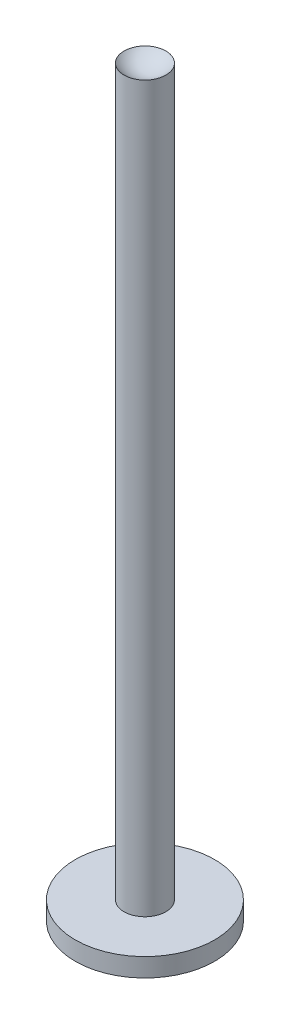
ISO-10303-21;
HEADER;
FILE_DESCRIPTION(('STEP AP214'),'2;1');
FILE_NAME('part.step','',(''),(''),'','','');
FILE_SCHEMA(('AUTOMOTIVE_DESIGN { 1 0 10303 214 1 1 1 1 }'));
ENDSEC;
DATA;
#1=APPLICATION_CONTEXT('core data for automotive mechanical design processes');
#2=APPLICATION_PROTOCOL_DEFINITION('international standard','automotive_design',2000,#1);
#3=PRODUCT_CONTEXT('',#1,'mechanical');
#4=PRODUCT('Part','Part','',(#3));
#5=PRODUCT_RELATED_PRODUCT_CATEGORY('part','',(#4));
#6=PRODUCT_DEFINITION_FORMATION('','',#4);
#7=PRODUCT_DEFINITION_CONTEXT('part definition',#1,'design');
#8=PRODUCT_DEFINITION('design','',#6,#7);
#9=PRODUCT_DEFINITION_SHAPE('','',#8);
#10=(LENGTH_UNIT() NAMED_UNIT(*) SI_UNIT(.MILLI.,.METRE.));
#11=(NAMED_UNIT(*) PLANE_ANGLE_UNIT() SI_UNIT($,.RADIAN.));
#12=(NAMED_UNIT(*) SI_UNIT($,.STERADIAN.) SOLID_ANGLE_UNIT());
#13=UNCERTAINTY_MEASURE_WITH_UNIT(LENGTH_MEASURE(1.E-05),#10,'distance_accuracy_value','');
#14=(GEOMETRIC_REPRESENTATION_CONTEXT(3) GLOBAL_UNCERTAINTY_ASSIGNED_CONTEXT((#13)) GLOBAL_UNIT_ASSIGNED_CONTEXT((#10,
#11,#12)) REPRESENTATION_CONTEXT('',''));
#15=CARTESIAN_POINT('',(0.,0.,0.));
#16=DIRECTION('',(0.,0.,1.));
#17=DIRECTION('',(1.,0.,0.));
#18=AXIS2_PLACEMENT_3D('',#15,#16,#17);
#19=CARTESIAN_POINT('',(0.,20.,0.));
#20=DIRECTION('',(0.,-1.,0.));
#21=DIRECTION('',(0.,0.,-1.));
#22=AXIS2_PLACEMENT_3D('',#19,#20,#21);
#23=CYLINDRICAL_SURFACE('',#22,75.);
#24=CARTESIAN_POINT('',(0.,20.,0.));
#25=DIRECTION('',(0.,1.,0.));
#26=DIRECTION('',(0.,0.,1.));
#27=AXIS2_PLACEMENT_3D('',#24,#25,#26);
#28=CIRCLE('',#27,75.);
#29=CARTESIAN_POINT('',(0.,20.,75.));
#30=VERTEX_POINT('',#29);
#31=EDGE_CURVE('E52',#30,#30,#28,.T.);
#32=ORIENTED_EDGE('',*,*,#31,.F.);
#33=EDGE_LOOP('',(#32));
#34=FACE_BOUND('',#33,.T.);
#35=CARTESIAN_POINT('',(0.,0.,0.));
#36=DIRECTION('',(0.,1.,0.));
#37=DIRECTION('',(0.,0.,1.));
#38=AXIS2_PLACEMENT_3D('',#35,#36,#37);
#39=CIRCLE('',#38,75.);
#40=CARTESIAN_POINT('',(0.,0.,75.));
#41=VERTEX_POINT('',#40);
#42=EDGE_CURVE('E48',#41,#41,#39,.T.);
#43=ORIENTED_EDGE('',*,*,#42,.T.);
#44=EDGE_LOOP('',(#43));
#45=FACE_BOUND('',#44,.T.);
#46=ADVANCED_FACE('F45',(#34,#45),#23,.T.);
#47=CARTESIAN_POINT('',(0.,20.,0.));
#48=DIRECTION('',(0.,1.,0.));
#49=DIRECTION('',(0.,0.,1.));
#50=AXIS2_PLACEMENT_3D('',#47,#48,#49);
#51=PLANE('',#50);
#52=CARTESIAN_POINT('',(0.,20.,0.));
#53=DIRECTION('',(0.,1.,0.));
#54=DIRECTION('',(0.,0.,1.));
#55=AXIS2_PLACEMENT_3D('',#52,#53,#54);
#56=CIRCLE('',#55,22.5);
#57=CARTESIAN_POINT('',(0.,20.,22.5));
#58=VERTEX_POINT('',#57);
#59=EDGE_CURVE('E12',#58,#58,#56,.T.);
#60=ORIENTED_EDGE('',*,*,#59,.F.);
#61=EDGE_LOOP('',(#60));
#62=FACE_BOUND('',#61,.T.);
#63=ORIENTED_EDGE('',*,*,#31,.T.);
#64=EDGE_LOOP('',(#63));
#65=FACE_BOUND('',#64,.T.);
#66=ADVANCED_FACE('F69',(#62,#65),#51,.T.);
#67=CARTESIAN_POINT('',(0.,0.,0.));
#68=DIRECTION('',(0.,1.,0.));
#69=DIRECTION('',(0.,0.,1.));
#70=AXIS2_PLACEMENT_3D('',#67,#68,#69);
#71=PLANE('',#70);
#72=ORIENTED_EDGE('',*,*,#42,.F.);
#73=EDGE_LOOP('',(#72));
#74=FACE_BOUND('',#73,.T.);
#75=ADVANCED_FACE('F66',(#74),#71,.F.);
#76=CARTESIAN_POINT('',(0.,800.,0.));
#77=DIRECTION('',(0.,-1.,0.));
#78=DIRECTION('',(0.,0.,-1.));
#79=AXIS2_PLACEMENT_3D('',#76,#77,#78);
#80=CYLINDRICAL_SURFACE('',#79,22.5);
#81=CARTESIAN_POINT('',(0.,800.,0.));
#82=DIRECTION('',(0.,-1.,0.));
#83=DIRECTION('',(0.,0.,-1.));
#84=AXIS2_PLACEMENT_3D('',#81,#82,#83);
#85=CIRCLE('',#84,22.5);
#86=CARTESIAN_POINT('',(0.,800.,-22.5));
#87=VERTEX_POINT('',#86);
#88=EDGE_CURVE('E58',#87,#87,#85,.T.);
#89=ORIENTED_EDGE('',*,*,#88,.T.);
#90=EDGE_LOOP('',(#89));
#91=FACE_BOUND('',#90,.T.);
#92=ORIENTED_EDGE('',*,*,#59,.T.);
#93=EDGE_LOOP('',(#92));
#94=FACE_BOUND('',#93,.T.);
#95=ADVANCED_FACE('F68',(#91,#94),#80,.T.);
#96=CARTESIAN_POINT('',(0.,820.3125,0.));
#97=DIRECTION('',(0.,-1.,0.));
#98=DIRECTION('',(0.,0.,1.));
#99=AXIS2_PLACEMENT_3D('',#96,#97,#98);
#100=SPHERICAL_SURFACE('',#99,30.3125);
#101=ORIENTED_EDGE('',*,*,#88,.F.);
#102=EDGE_LOOP('',(#101));
#103=FACE_BOUND('',#102,.T.);
#104=ADVANCED_FACE('F74',(#103),#100,.F.);
#105=CLOSED_SHELL('',(#46,#66,#75,#95,#104));
#106=MANIFOLD_SOLID_BREP('B2',#105);
#107=ADVANCED_BREP_SHAPE_REPRESENTATION('',(#18,#106),#14);
#108=SHAPE_DEFINITION_REPRESENTATION(#9,#107);
ENDSEC;
END-ISO-10303-21;
